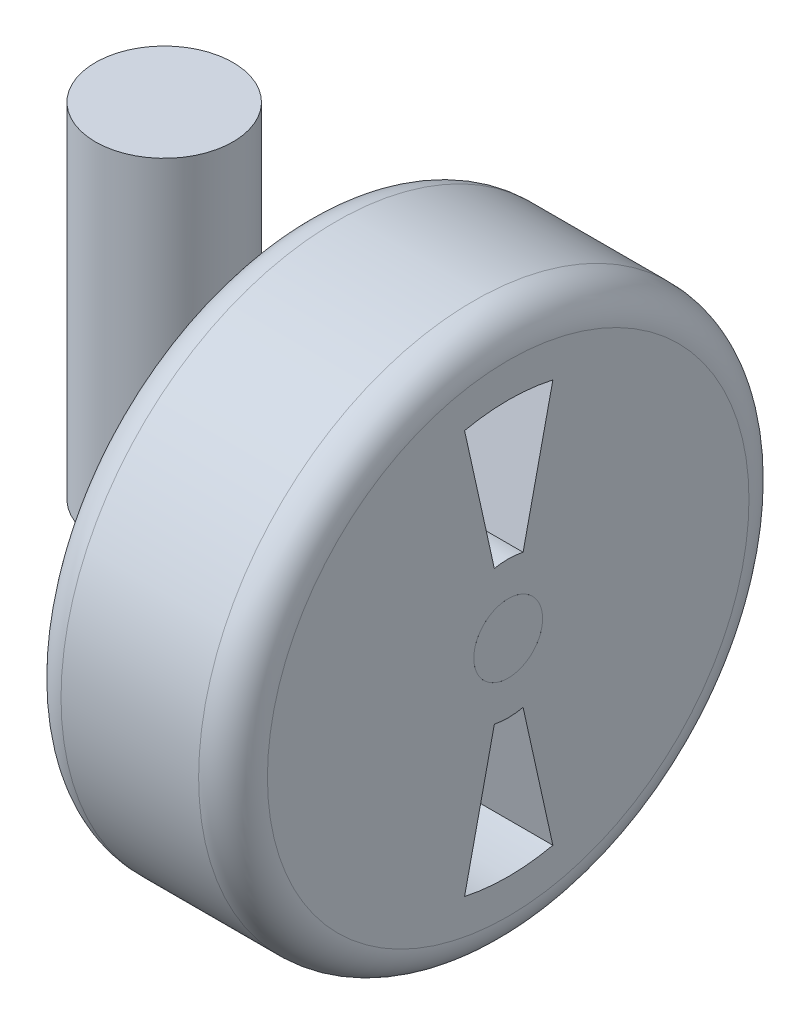
ISO-10303-21;
HEADER;
FILE_DESCRIPTION(('STEP AP214'),'2;1');
FILE_NAME('part.step','',(''),(''),'','','');
FILE_SCHEMA(('AUTOMOTIVE_DESIGN { 1 0 10303 214 1 1 1 1 }'));
ENDSEC;
DATA;
#1=APPLICATION_CONTEXT('core data for automotive mechanical design processes');
#2=APPLICATION_PROTOCOL_DEFINITION('international standard','automotive_design',2000,#1);
#3=PRODUCT_CONTEXT('',#1,'mechanical');
#4=PRODUCT('Part','Part','',(#3));
#5=PRODUCT_RELATED_PRODUCT_CATEGORY('part','',(#4));
#6=PRODUCT_DEFINITION_FORMATION('','',#4);
#7=PRODUCT_DEFINITION_CONTEXT('part definition',#1,'design');
#8=PRODUCT_DEFINITION('design','',#6,#7);
#9=PRODUCT_DEFINITION_SHAPE('','',#8);
#10=(LENGTH_UNIT() NAMED_UNIT(*) SI_UNIT(.MILLI.,.METRE.));
#11=(NAMED_UNIT(*) PLANE_ANGLE_UNIT() SI_UNIT($,.RADIAN.));
#12=(NAMED_UNIT(*) SI_UNIT($,.STERADIAN.) SOLID_ANGLE_UNIT());
#13=UNCERTAINTY_MEASURE_WITH_UNIT(LENGTH_MEASURE(1.E-05),#10,'distance_accuracy_value','');
#14=(GEOMETRIC_REPRESENTATION_CONTEXT(3) GLOBAL_UNCERTAINTY_ASSIGNED_CONTEXT((#13)) GLOBAL_UNIT_ASSIGNED_CONTEXT((#10,
#11,#12)) REPRESENTATION_CONTEXT('',''));
#15=CARTESIAN_POINT('',(0.,0.,0.));
#16=DIRECTION('',(0.,0.,1.));
#17=DIRECTION('',(1.,0.,0.));
#18=AXIS2_PLACEMENT_3D('',#15,#16,#17);
#19=CARTESIAN_POINT('',(0.,127.,0.));
#20=DIRECTION('',(0.,-1.,0.));
#21=DIRECTION('',(0.,0.,-1.));
#22=AXIS2_PLACEMENT_3D('',#19,#20,#21);
#23=CYLINDRICAL_SURFACE('',#22,25.4);
#24=CARTESIAN_POINT('',(21.9970452561247,19.05,-12.7));
#25=CARTESIAN_POINT('',(21.9970471602128,19.3810420807461,-12.6999985647494));
#26=CARTESIAN_POINT('',(22.0045437862155,19.7121130244855,-12.6870391369613));
#27=CARTESIAN_POINT('',(22.0342519284664,20.3717034976564,-12.6353713338878));
#28=CARTESIAN_POINT('',(22.0564702952349,20.7002217672053,-12.5966509711401));
#29=CARTESIAN_POINT('',(22.1148440208644,21.3526264227658,-12.4938849250183));
#30=CARTESIAN_POINT('',(22.1510249211168,21.6765031854515,-12.4297928240411));
#31=CARTESIAN_POINT('',(22.2360170030325,22.316670048592,-12.2770991138377));
#32=CARTESIAN_POINT('',(22.284826974256,22.6329608729521,-12.1884998534566));
#33=CARTESIAN_POINT('',(22.3931480103301,23.2543012598049,-11.9883186278969));
#34=CARTESIAN_POINT('',(22.4525983094468,23.5594033801427,-11.8768666712366));
#35=CARTESIAN_POINT('',(22.5805721347808,24.1586234616995,-11.6317181381331));
#36=CARTESIAN_POINT('',(22.6490991713607,24.4527371165001,-11.4980129502544));
#37=CARTESIAN_POINT('',(22.8653561130759,25.3161442355337,-11.0652401328367));
#38=CARTESIAN_POINT('',(23.0238704837284,25.8670919696492,-10.7343236683619));
#39=CARTESIAN_POINT('',(23.3676412352835,26.953442979612,-9.96516055573082));
#40=CARTESIAN_POINT('',(23.5540249305769,27.4838162959334,-9.5203126301066));
#41=CARTESIAN_POINT('',(23.8309378120557,28.2203478300108,-8.79284622642539));
#42=CARTESIAN_POINT('',(23.9228647991282,28.4561715803135,-8.54011742208882));
#43=CARTESIAN_POINT('',(24.1036457517521,28.9068945224131,-8.01567565449754));
#44=CARTESIAN_POINT('',(24.1925008194246,29.121801269966,-7.7439696076812));
#45=CARTESIAN_POINT('',(24.370853998843,29.5432075794466,-7.16377890210735));
#46=CARTESIAN_POINT('',(24.4599875552318,29.7481502259311,-6.85404964117503));
#47=CARTESIAN_POINT('',(24.6298470545705,30.1310109612756,-6.21607422891501));
#48=CARTESIAN_POINT('',(24.7105725146455,30.3089274983018,-5.88782701577314));
#49=CARTESIAN_POINT('',(24.8612516926925,30.6358915031511,-5.21506652074053));
#50=CARTESIAN_POINT('',(24.9312106298145,30.7849529677731,-4.87056122657622));
#51=CARTESIAN_POINT('',(25.0583005241644,31.0525958823117,-4.16762302685623));
#52=CARTESIAN_POINT('',(25.11543284386,31.1711805697233,-3.80919160530934));
#53=CARTESIAN_POINT('',(25.2115397591581,31.369036569119,-3.10720251540758));
#54=CARTESIAN_POINT('',(25.2515169220277,31.4505044171783,-2.76440059738313));
#55=CARTESIAN_POINT('',(25.3177425338566,31.5848119416637,-2.07192012055632));
#56=CARTESIAN_POINT('',(25.3439915797081,31.637652862779,-1.72224186142015));
#57=CARTESIAN_POINT('',(25.3819888668002,31.7139825733086,-1.01909136302437));
#58=CARTESIAN_POINT('',(25.3937444976109,31.7374863205646,-0.665621149929051));
#59=CARTESIAN_POINT('',(25.4024302708841,31.7548623520299,0.0422200815740275));
#60=CARTESIAN_POINT('',(25.3993613203907,31.7487364491338,0.396591043543345));
#61=CARTESIAN_POINT('',(25.3794055661792,31.7087707869769,1.07234401308664));
#62=CARTESIAN_POINT('',(25.3637453457987,31.6773909089866,1.39391142368825));
#63=CARTESIAN_POINT('',(25.320540629412,31.5903830254822,2.03291731220707));
#64=CARTESIAN_POINT('',(25.2929969701013,31.5347567271201,2.35035607919535));
#65=CARTESIAN_POINT('',(25.2266850381294,31.39986165508,2.97897125371334));
#66=CARTESIAN_POINT('',(25.1879163998152,31.3205921112222,3.29014745688725));
#67=CARTESIAN_POINT('',(25.1000573303477,31.1392170400231,3.90427386213677));
#68=CARTESIAN_POINT('',(25.0509665284666,31.0371106924736,4.20722376831778));
#69=CARTESIAN_POINT('',(24.9428270563849,30.8094553501855,4.80724352433844));
#70=CARTESIAN_POINT('',(24.8836506570485,30.6836031085568,5.1041750988441));
#71=CARTESIAN_POINT('',(24.7571386689521,30.4104823246213,5.68619260071747));
#72=CARTESIAN_POINT('',(24.6898030899667,30.2632138079709,5.9712785422755));
#73=CARTESIAN_POINT('',(24.5484061586244,29.9483499085496,6.52827145034378));
#74=CARTESIAN_POINT('',(24.4743441844574,29.7807526460411,6.80017719486261));
#75=CARTESIAN_POINT('',(24.321008981523,29.4262720280837,7.32970282693975));
#76=CARTESIAN_POINT('',(24.241733732656,29.2393811803602,7.58731710454069));
#77=CARTESIAN_POINT('',(24.0719525020219,28.8289077346986,8.1107189326513));
#78=CARTESIAN_POINT('',(23.9810927057987,28.6035269187307,8.37498325169425));
#79=CARTESIAN_POINT('',(23.7972913728668,28.1322983961376,8.88381203754073));
#80=CARTESIAN_POINT('',(23.7043497188136,27.8864495336934,9.12837539030551));
#81=CARTESIAN_POINT('',(23.5186138315105,27.3753768985287,9.59678718723074));
#82=CARTESIAN_POINT('',(23.4258197341869,27.1101405767493,9.82062199798168));
#83=CARTESIAN_POINT('',(23.2427999635405,26.561630821775,10.2462645447203));
#84=CARTESIAN_POINT('',(23.1525747518022,26.2783541762739,10.4480683403477));
#85=CARTESIAN_POINT('',(22.9715514343696,25.6764402643528,10.8405474751142));
#86=CARTESIAN_POINT('',(22.8810846524641,25.3567000961703,11.0296893051339));
#87=CARTESIAN_POINT('',(22.7088984125069,24.7001621973306,11.3799836986017));
#88=CARTESIAN_POINT('',(22.6271749714927,24.3633723374261,11.5411490275416));
#89=CARTESIAN_POINT('',(22.4754617527209,23.6748286806348,11.8338838194025));
#90=CARTESIAN_POINT('',(22.4054650808563,23.3230838293027,11.9654706870086));
#91=CARTESIAN_POINT('',(22.2799865885559,22.6069602897252,12.1975260044049));
#92=CARTESIAN_POINT('',(22.2245027890992,22.242583331716,12.2979986973657));
#93=CARTESIAN_POINT('',(22.1342262843656,21.5334790141535,12.4596912887769));
#94=CARTESIAN_POINT('',(22.098142911759,21.1894808921785,12.5233897061292));
#95=CARTESIAN_POINT('',(22.0418220540794,20.4961162926004,12.6222558976789));
#96=CARTESIAN_POINT('',(22.0215836735453,20.1467501195044,12.6574252841648));
#97=CARTESIAN_POINT('',(21.9978227828486,19.4459470423252,12.6986756625791));
#98=CARTESIAN_POINT('',(21.994290174051,19.0945115178566,12.7047742278297));
#99=CARTESIAN_POINT('',(22.0040693445831,18.392593499876,12.6878302022715));
#100=CARTESIAN_POINT('',(22.0173799869267,18.0421109436354,12.6647895784734));
#101=CARTESIAN_POINT('',(22.0579043046366,17.3835445009991,12.5940573760551));
#102=CARTESIAN_POINT('',(22.0834315216201,17.0750295052712,12.5493492475133));
#103=CARTESIAN_POINT('',(22.1465318454431,16.4632099329642,12.4376541859353));
#104=CARTESIAN_POINT('',(22.184108940291,16.1599071164627,12.3706598768256));
#105=CARTESIAN_POINT('',(22.2701258086824,15.5605171053264,12.215128963231));
#106=CARTESIAN_POINT('',(22.3185641324,15.2644289534753,12.1265952338312));
#107=CARTESIAN_POINT('',(22.4249117667195,14.6809014913133,11.9287859618344));
#108=CARTESIAN_POINT('',(22.4828248323198,14.3934656637554,11.8195021928819));
#109=CARTESIAN_POINT('',(22.6093845553946,13.8157553865419,11.5756402427838));
#110=CARTESIAN_POINT('',(22.6784016201461,13.5259551192354,11.4401320002685));
#111=CARTESIAN_POINT('',(22.8232288817731,12.9586078091804,11.1483965411298));
#112=CARTESIAN_POINT('',(22.8990419788175,12.6810660738329,10.9921604652366));
#113=CARTESIAN_POINT('',(23.0555590560225,12.1394250404758,10.6599674616086));
#114=CARTESIAN_POINT('',(23.1362640138934,11.875328449211,10.4840065855742));
#115=CARTESIAN_POINT('',(23.3006827313257,11.3616293649374,10.113322779748));
#116=CARTESIAN_POINT('',(23.3843967051249,11.1120279072843,9.91859851236337));
#117=CARTESIAN_POINT('',(23.5636645058326,10.5976922140596,9.4855329974286));
#118=CARTESIAN_POINT('',(23.6593777533432,10.3350312258121,9.2447894502468));
#119=CARTESIAN_POINT('',(23.8497410423583,9.83074538024891,8.74197321743339));
#120=CARTESIAN_POINT('',(23.9443913904567,9.58911431363089,8.47990687209977));
#121=CARTESIAN_POINT('',(24.1302993318609,9.12800953049297,7.93545520062454));
#122=CARTESIAN_POINT('',(24.2215543349948,8.90855251925937,7.65305482570265));
#123=CARTESIAN_POINT('',(24.3982173985347,8.49356827963927,7.06964182281789));
#124=CARTESIAN_POINT('',(24.4836279404689,8.29803086698485,6.76863719875104));
#125=CARTESIAN_POINT('',(24.6485996720327,7.92742205617927,6.14121491873794));
#126=CARTESIAN_POINT('',(24.7279432691808,7.75303806015415,5.81433284669376));
#127=CARTESIAN_POINT('',(24.8759160322661,7.43271184087587,5.14455133013142));
#128=CARTESIAN_POINT('',(24.9445448390965,7.28677057084116,4.80165134927256));
#129=CARTESIAN_POINT('',(25.0690086800244,7.02509088055367,4.10253106573799));
#130=CARTESIAN_POINT('',(25.1248528498603,6.9093308848819,3.74632048771279));
#131=CARTESIAN_POINT('',(25.2220758898254,6.70938578449528,3.02322650574832));
#132=CARTESIAN_POINT('',(25.2634564752322,6.625196935582,2.65634437297284));
#133=CARTESIAN_POINT('',(25.3273539195209,6.49580929596041,1.94920235554088));
#134=CARTESIAN_POINT('',(25.3512536510551,6.44774089246716,1.60959001490067));
#135=CARTESIAN_POINT('',(25.3853816074126,6.37922689235229,0.926912035885021));
#136=CARTESIAN_POINT('',(25.3956106999074,6.35877954262954,0.583846618068023));
#137=CARTESIAN_POINT('',(25.4021120060045,6.34577535186779,-0.102839446284004));
#138=CARTESIAN_POINT('',(25.3983883777696,6.35321020143045,-0.446459896899585));
#139=CARTESIAN_POINT('',(25.3770971994885,6.3958542023007,-1.13153389091492));
#140=CARTESIAN_POINT('',(25.3595300305546,6.4310625890036,-1.47298749370707));
#141=CARTESIAN_POINT('',(25.3126435066068,6.52556490034316,-2.12858527568835));
#142=CARTESIAN_POINT('',(25.2841765669811,6.58311530426898,-2.44304419112651));
#143=CARTESIAN_POINT('',(25.2162691565626,6.72142103246127,-3.0655837436746));
#144=CARTESIAN_POINT('',(25.1768293052811,6.80217504670158,-3.3736647398158));
#145=CARTESIAN_POINT('',(25.0878735123424,6.9860922027362,-3.98158173319984));
#146=CARTESIAN_POINT('',(25.0383567873887,7.08925708661679,-4.28141708743362));
#147=CARTESIAN_POINT('',(24.9303397913062,7.31705941391041,-4.87114333181489));
#148=CARTESIAN_POINT('',(24.8718391009164,7.44169785947861,-5.16103375708247));
#149=CARTESIAN_POINT('',(24.7444293333949,7.71720104299412,-5.74153755123178));
#150=CARTESIAN_POINT('',(24.6751823649851,7.86895872813089,-6.03165271619898));
#151=CARTESIAN_POINT('',(24.5298098520684,8.19354461094811,-6.59802427573064));
#152=CARTESIAN_POINT('',(24.4536841788377,8.3663732029571,-6.87428041079562));
#153=CARTESIAN_POINT('',(24.2961802971371,8.73197718704439,-7.41175170677076));
#154=CARTESIAN_POINT('',(24.2148010722428,8.92475644342996,-7.67296393847169));
#155=CARTESIAN_POINT('',(24.0484958467777,9.32919030921192,-8.17929680023456));
#156=CARTESIAN_POINT('',(23.9635684730117,9.54085226320227,-8.42441110393882));
#157=CARTESIAN_POINT('',(23.7834500990398,10.0038737885493,-8.92098717319141));
#158=CARTESIAN_POINT('',(23.688078153342,10.2570879541916,-9.17065712465206));
#159=CARTESIAN_POINT('',(23.4977167440241,10.783626008772,-9.64797087813653));
#160=CARTESIAN_POINT('',(23.4027272917455,11.0569504894491,-9.87561403157303));
#161=CARTESIAN_POINT('',(23.2156147898567,11.6226144173546,-10.3077994956351));
#162=CARTESIAN_POINT('',(23.123494190191,11.914969491805,-10.5123224338757));
#163=CARTESIAN_POINT('',(22.9448378372625,12.5171405545823,-10.896759382453));
#164=CARTESIAN_POINT('',(22.858302987056,12.826959351203,-11.0766694188231));
#165=CARTESIAN_POINT('',(22.6908951069765,13.4726363779299,-11.4157868639676));
#166=CARTESIAN_POINT('',(22.6102916419609,13.8090104904963,-11.5741482082511));
#167=CARTESIAN_POINT('',(22.4609070473123,14.4964526984344,-11.8614454203001));
#168=CARTESIAN_POINT('',(22.3921197744437,14.847513039658,-11.9903965899069));
#169=CARTESIAN_POINT('',(22.2692493503278,15.5610701147008,-12.2170838217044));
#170=CARTESIAN_POINT('',(22.2151284619609,15.9235347671628,-12.3149001105845));
#171=CARTESIAN_POINT('',(22.1237750343668,16.6575556131312,-12.4782771120638));
#172=CARTESIAN_POINT('',(22.0865306888318,17.0291052586806,-12.5438603766174));
#173=CARTESIAN_POINT('',(22.0382476199109,17.675854352842,-12.6284304598707));
#174=CARTESIAN_POINT('',(22.0228342714581,17.9497333710954,-12.6552434069377));
#175=CARTESIAN_POINT('',(22.0022319553292,18.4990681944843,-12.6910293708987));
#176=CARTESIAN_POINT('',(21.9970436716423,18.7745241038674,-12.7000011943404));
#177=CARTESIAN_POINT('',(21.9970452561247,19.05,-12.7));
#178=B_SPLINE_CURVE_WITH_KNOTS('',3,(#24,#25,#26,#27,#28,#29,#30,#31,#32,#33,#34,#35,#36,#37,
#38,#39,#40,#41,#42,#43,#44,#45,#46,#47,#48,#49,#50,#51,#52,#53,#54,#55,#56,#57,#58,#59,#60,#61,
#62,#63,#64,#65,#66,#67,#68,#69,#70,#71,#72,#73,#74,#75,#76,#77,#78,#79,#80,#81,#82,#83,#84,#85,
#86,#87,#88,#89,#90,#91,#92,#93,#94,#95,#96,#97,#98,#99,#100,#101,#102,#103,#104,#105,#106,#107,
#108,#109,#110,#111,#112,#113,#114,#115,#116,#117,#118,#119,#120,#121,#122,#123,#124,#125,#126,
#127,#128,#129,#130,#131,#132,#133,#134,#135,#136,#137,#138,#139,#140,#141,#142,#143,#144,#145,
#146,#147,#148,#149,#150,#151,#152,#153,#154,#155,#156,#157,#158,#159,#160,#161,#162,#163,#164,
#165,#166,#167,#168,#169,#170,#171,#172,#173,#174,#175,#176,#177),.UNSPECIFIED.,.T.,.F.,(4,2,2,
2,2,2,2,2,2,2,2,2,2,2,2,2,2,2,2,2,2,2,2,2,2,2,2,2,2,2,2,2,2,2,2,2,2,2,2,2,2,2,2,2,2,2,2,2,2,2,2,
2,2,2,2,2,2,2,2,2,2,2,2,2,2,2,2,2,2,2,2,2,2,2,2,2,4),(0.,0.992841256773457,1.98614484069135,
2.98127413516308,3.97630808626216,4.96583099917635,5.95573772646566,7.93368817155649,
10.0747759271307,11.1468942610208,12.218623869757,13.3629886651861,14.5074191449963,
15.6512930944215,16.7950454818372,17.857435006988,18.9197783360939,19.9815797976435,
21.0433162935313,22.0125928506763,22.9818011736155,23.9510410720043,24.9203157872719,
25.9029281283044,26.8855392921968,27.8682413845279,28.8513265352096,29.9271929305077,
31.0031201206287,32.0797500083507,33.1565721424736,34.3021563419872,35.4472164371095,
36.5916009769249,37.7358293834202,38.789438498316,39.8429880654364,40.8959006806151,
41.9487422238141,42.886017324986,43.8236029459353,44.7610634864151,45.6988964621831,
46.6797322342173,47.6609885833768,48.6424417018712,49.623964837417,50.7295147964185,
51.8347372150265,52.9407861630636,54.0463625363864,55.1815136853403,56.3167028707683,
57.4510783146944,58.5853191841304,59.6154461363638,60.6455077036341,61.675262318375,
62.7049885849902,63.6667347316751,64.6284265908971,65.5901932330307,66.5520047722631,
67.5549064405592,68.5578268804,69.5609419439473,70.5644488935119,71.6677265518938,
72.7710366868203,73.8752645363012,74.9796704630673,76.1193951815199,77.2585255520905,
78.3946964541357,79.5300712943583,80.3562065716749,81.1823971100821),.UNSPECIFIED.);
#179=CARTESIAN_POINT('',(21.9970452561247,19.05,-12.7));
#180=VERTEX_POINT('',#179);
#181=EDGE_CURVE('P0_E25',#180,#180,#178,.T.);
#182=ORIENTED_EDGE('',*,*,#181,.F.);
#183=EDGE_LOOP('',(#182));
#184=FACE_BOUND('',#183,.T.);
#185=CARTESIAN_POINT('',(0.,127.,0.));
#186=DIRECTION('',(0.,1.,0.));
#187=DIRECTION('',(0.,0.,1.));
#188=AXIS2_PLACEMENT_3D('',#185,#186,#187);
#189=CIRCLE('',#188,25.4);
#190=CARTESIAN_POINT('',(0.,127.,25.4));
#191=VERTEX_POINT('',#190);
#192=EDGE_CURVE('P0_E10',#191,#191,#189,.T.);
#193=ORIENTED_EDGE('',*,*,#192,.F.);
#194=EDGE_LOOP('',(#193));
#195=FACE_BOUND('',#194,.T.);
#196=CARTESIAN_POINT('',(0.,0.,0.));
#197=DIRECTION('',(0.,1.,0.));
#198=DIRECTION('',(0.,0.,1.));
#199=AXIS2_PLACEMENT_3D('',#196,#197,#198);
#200=CIRCLE('',#199,25.4);
#201=CARTESIAN_POINT('',(0.,0.,25.4));
#202=VERTEX_POINT('',#201);
#203=EDGE_CURVE('P0_E18',#202,#202,#200,.T.);
#204=ORIENTED_EDGE('',*,*,#203,.T.);
#205=EDGE_LOOP('',(#204));
#206=FACE_BOUND('',#205,.T.);
#207=ADVANCED_FACE('P0_F15',(#184,#195,#206),#23,.T.);
#208=CARTESIAN_POINT('',(0.,127.,0.));
#209=DIRECTION('',(0.,1.,0.));
#210=DIRECTION('',(0.,0.,1.));
#211=AXIS2_PLACEMENT_3D('',#208,#209,#210);
#212=PLANE('',#211);
#213=ORIENTED_EDGE('',*,*,#192,.T.);
#214=EDGE_LOOP('',(#213));
#215=FACE_BOUND('',#214,.T.);
#216=ADVANCED_FACE('P0_F50',(#215),#212,.T.);
#217=CARTESIAN_POINT('',(0.,0.,0.));
#218=DIRECTION('',(0.,1.,0.));
#219=DIRECTION('',(0.,0.,1.));
#220=AXIS2_PLACEMENT_3D('',#217,#218,#219);
#221=PLANE('',#220);
#222=ORIENTED_EDGE('',*,*,#203,.F.);
#223=EDGE_LOOP('',(#222));
#224=FACE_BOUND('',#223,.T.);
#225=ADVANCED_FACE('P0_F42',(#224),#221,.F.);
#226=CARTESIAN_POINT('',(127.,19.05,0.));
#227=DIRECTION('',(1.,0.,0.));
#228=DIRECTION('',(0.,0.,-1.));
#229=AXIS2_PLACEMENT_3D('',#226,#227,#228);
#230=PLANE('',#229);
#231=CARTESIAN_POINT('',(127.,19.05,0.));
#232=DIRECTION('',(1.,0.,0.));
#233=DIRECTION('',(0.,0.,-1.));
#234=AXIS2_PLACEMENT_3D('',#231,#232,#233);
#235=CIRCLE('',#234,12.7);
#236=CARTESIAN_POINT('',(127.,19.05,-12.7));
#237=VERTEX_POINT('',#236);
#238=EDGE_CURVE('P0_E34',#237,#237,#235,.T.);
#239=ORIENTED_EDGE('',*,*,#238,.T.);
#240=EDGE_LOOP('',(#239));
#241=FACE_BOUND('',#240,.T.);
#242=ADVANCED_FACE('P0_F40',(#241),#230,.T.);
#243=CARTESIAN_POINT('',(-25.401,19.05,0.));
#244=DIRECTION('',(1.,0.,0.));
#245=DIRECTION('',(0.,0.,-1.));
#246=AXIS2_PLACEMENT_3D('',#243,#244,#245);
#247=CYLINDRICAL_SURFACE('',#246,12.7);
#248=ORIENTED_EDGE('',*,*,#238,.F.);
#249=EDGE_LOOP('',(#248));
#250=FACE_BOUND('',#249,.T.);
#251=ORIENTED_EDGE('',*,*,#181,.T.);
#252=EDGE_LOOP('',(#251));
#253=FACE_BOUND('',#252,.T.);
#254=ADVANCED_FACE('P0_F35',(#250,#253),#247,.T.);
#255=CLOSED_SHELL('',(#207,#216,#225,#242,#254));
#256=MANIFOLD_SOLID_BREP('P0_B1',#255);
#257=CARTESIAN_POINT('',(127.,19.05,0.));
#258=DIRECTION('',(-1.,0.,0.));
#259=DIRECTION('',(0.,0.,1.));
#260=AXIS2_PLACEMENT_3D('',#257,#258,#259);
#261=PLANE('',#260);
#262=CARTESIAN_POINT('',(127.,19.05,0.));
#263=DIRECTION('',(-1.,0.,0.));
#264=DIRECTION('',(0.,0.,1.));
#265=AXIS2_PLACEMENT_3D('',#262,#263,#264);
#266=CIRCLE('',#265,12.7);
#267=CARTESIAN_POINT('',(127.,19.05,12.7));
#268=VERTEX_POINT('',#267);
#269=EDGE_CURVE('P1_E147',#268,#268,#266,.T.);
#270=ORIENTED_EDGE('',*,*,#269,.T.);
#271=EDGE_LOOP('',(#270));
#272=FACE_BOUND('',#271,.T.);
#273=CARTESIAN_POINT('',(127.,19.05,0.));
#274=DIRECTION('',(-1.,0.,0.));
#275=DIRECTION('',(0.,0.,1.));
#276=AXIS2_PLACEMENT_3D('',#273,#274,#275);
#277=CIRCLE('',#276,88.9);
#278=CARTESIAN_POINT('',(127.,19.05,88.9));
#279=VERTEX_POINT('',#278);
#280=EDGE_CURVE('P1_E10',#279,#279,#277,.F.);
#281=ORIENTED_EDGE('',*,*,#280,.T.);
#282=EDGE_LOOP('',(#281));
#283=FACE_BOUND('',#282,.T.);
#284=DIRECTION('',(0.,-0.976296007119933,0.216439613938104));
#285=VECTOR('',#284,1.);
#286=CARTESIAN_POINT('',(127.,43.8479185808463,-5.49756619402784));
#287=LINE('',#286,#285);
#288=CARTESIAN_POINT('',(127.,93.4518390712533,-16.4944906129159));
#289=VERTEX_POINT('',#288);
#290=CARTESIAN_POINT('',(127.,43.8479185808463,-5.49756619402784));
#291=VERTEX_POINT('',#290);
#292=EDGE_CURVE('P1_E125',#289,#291,#287,.T.);
#293=ORIENTED_EDGE('',*,*,#292,.T.);
#294=CARTESIAN_POINT('',(127.,19.05,0.));
#295=DIRECTION('',(1.,0.,0.));
#296=DIRECTION('',(0.,0.,1.));
#297=AXIS2_PLACEMENT_3D('',#294,#295,#296);
#298=CIRCLE('',#297,25.4);
#299=CARTESIAN_POINT('',(127.,43.9305500937605,5.11059947871828));
#300=VERTEX_POINT('',#299);
#301=EDGE_CURVE('P1_E115',#291,#300,#298,.T.);
#302=ORIENTED_EDGE('',*,*,#301,.T.);
#303=DIRECTION('',(0.,0.976296007119933,0.216439613938103));
#304=VECTOR('',#303,1.);
#305=CARTESIAN_POINT('',(127.,43.9305500937605,5.11059947871828));
#306=LINE('',#305,#304);
#307=CARTESIAN_POINT('',(127.,93.536476781913,16.1079686609387));
#308=VERTEX_POINT('',#307);
#309=EDGE_CURVE('P1_E118',#300,#308,#306,.T.);
#310=ORIENTED_EDGE('',*,*,#309,.T.);
#311=CARTESIAN_POINT('',(127.,19.05,0.));
#312=DIRECTION('',(-1.,0.,0.));
#313=DIRECTION('',(0.,0.,1.));
#314=AXIS2_PLACEMENT_3D('',#311,#312,#313);
#315=CIRCLE('',#314,76.2082795880097);
#316=EDGE_CURVE('P1_E122',#308,#289,#315,.T.);
#317=ORIENTED_EDGE('',*,*,#316,.T.);
#318=EDGE_LOOP('',(#293,#302,#310,#317));
#319=FACE_BOUND('',#318,.T.);
#320=CARTESIAN_POINT('',(127.,19.05,0.));
#321=DIRECTION('',(-1.,0.,0.));
#322=DIRECTION('',(0.,0.,1.));
#323=AXIS2_PLACEMENT_3D('',#320,#321,#322);
#324=CIRCLE('',#323,25.4);
#325=CARTESIAN_POINT('',(127.,-5.7479185808463,-5.49756619402784));
#326=VERTEX_POINT('',#325);
#327=CARTESIAN_POINT('',(127.,-5.83055009376048,5.11059947871828));
#328=VERTEX_POINT('',#327);
#329=EDGE_CURVE('P1_E89',#326,#328,#324,.T.);
#330=ORIENTED_EDGE('',*,*,#329,.F.);
#331=DIRECTION('',(0.,0.976296007119933,0.216439613938104));
#332=VECTOR('',#331,1.);
#333=CARTESIAN_POINT('',(127.,-5.7479185808463,-5.49756619402784));
#334=LINE('',#333,#332);
#335=CARTESIAN_POINT('',(127.,-55.3518390712534,-16.4944906129159));
#336=VERTEX_POINT('',#335);
#337=EDGE_CURVE('P1_E81',#336,#326,#334,.T.);
#338=ORIENTED_EDGE('',*,*,#337,.F.);
#339=CARTESIAN_POINT('',(127.,19.05,0.));
#340=DIRECTION('',(1.,0.,0.));
#341=DIRECTION('',(0.,0.,1.));
#342=AXIS2_PLACEMENT_3D('',#339,#340,#341);
#343=CIRCLE('',#342,76.2082795880097);
#344=CARTESIAN_POINT('',(127.,-55.436476781913,16.1079686609387));
#345=VERTEX_POINT('',#344);
#346=EDGE_CURVE('P1_E88',#345,#336,#343,.T.);
#347=ORIENTED_EDGE('',*,*,#346,.F.);
#348=DIRECTION('',(0.,-0.976296007119933,0.216439613938103));
#349=VECTOR('',#348,1.);
#350=CARTESIAN_POINT('',(127.,-5.83055009376048,5.11059947871828));
#351=LINE('',#350,#349);
#352=EDGE_CURVE('P1_E93',#328,#345,#351,.T.);
#353=ORIENTED_EDGE('',*,*,#352,.F.);
#354=EDGE_LOOP('',(#330,#338,#347,#353));
#355=FACE_BOUND('',#354,.T.);
#356=ADVANCED_FACE('P1_F16',(#272,#283,#319,#355),#261,.F.);
#357=CARTESIAN_POINT('',(50.8,19.05,0.));
#358=DIRECTION('',(-1.,0.,0.));
#359=DIRECTION('',(0.,0.,1.));
#360=AXIS2_PLACEMENT_3D('',#357,#358,#359);
#361=PLANE('',#360);
#362=CARTESIAN_POINT('',(50.8,19.05,0.));
#363=DIRECTION('',(1.,0.,0.));
#364=DIRECTION('',(0.,0.,1.));
#365=AXIS2_PLACEMENT_3D('',#362,#363,#364);
#366=CIRCLE('',#365,25.4);
#367=CARTESIAN_POINT('',(50.8,43.8479185808463,-5.49756619402784));
#368=VERTEX_POINT('',#367);
#369=CARTESIAN_POINT('',(50.8,43.9305500937605,5.11059947871828));
#370=VERTEX_POINT('',#369);
#371=EDGE_CURVE('P1_E111',#368,#370,#366,.T.);
#372=ORIENTED_EDGE('',*,*,#371,.F.);
#373=DIRECTION('',(0.,-0.976296007119933,0.216439613938104));
#374=VECTOR('',#373,1.);
#375=CARTESIAN_POINT('',(50.8,43.8479185808463,-5.49756619402784));
#376=LINE('',#375,#374);
#377=CARTESIAN_POINT('',(50.8,93.4518390712533,-16.4944906129159));
#378=VERTEX_POINT('',#377);
#379=EDGE_CURVE('P1_E119',#378,#368,#376,.T.);
#380=ORIENTED_EDGE('',*,*,#379,.F.);
#381=CARTESIAN_POINT('',(50.8,19.05,0.));
#382=DIRECTION('',(-1.,0.,0.));
#383=DIRECTION('',(0.,0.,1.));
#384=AXIS2_PLACEMENT_3D('',#381,#382,#383);
#385=CIRCLE('',#384,76.2082795880097);
#386=CARTESIAN_POINT('',(50.8,93.536476781913,16.1079686609387));
#387=VERTEX_POINT('',#386);
#388=EDGE_CURVE('P1_E133',#387,#378,#385,.T.);
#389=ORIENTED_EDGE('',*,*,#388,.F.);
#390=DIRECTION('',(0.,0.976296007119933,0.216439613938103));
#391=VECTOR('',#390,1.);
#392=CARTESIAN_POINT('',(50.8,43.9305500937605,5.11059947871828));
#393=LINE('',#392,#391);
#394=EDGE_CURVE('P1_E130',#370,#387,#393,.T.);
#395=ORIENTED_EDGE('',*,*,#394,.F.);
#396=EDGE_LOOP('',(#372,#380,#389,#395));
#397=FACE_BOUND('',#396,.T.);
#398=CARTESIAN_POINT('',(50.8,19.05,0.));
#399=DIRECTION('',(-1.,0.,0.));
#400=DIRECTION('',(0.,0.,1.));
#401=AXIS2_PLACEMENT_3D('',#398,#399,#400);
#402=CIRCLE('',#401,88.9);
#403=CARTESIAN_POINT('',(50.8,19.05,88.9));
#404=VERTEX_POINT('',#403);
#405=EDGE_CURVE('P1_E150',#404,#404,#402,.T.);
#406=ORIENTED_EDGE('',*,*,#405,.T.);
#407=EDGE_LOOP('',(#406));
#408=FACE_BOUND('',#407,.T.);
#409=CARTESIAN_POINT('',(50.8,19.05,0.));
#410=DIRECTION('',(-1.,0.,0.));
#411=DIRECTION('',(0.,0.,1.));
#412=AXIS2_PLACEMENT_3D('',#409,#410,#411);
#413=CIRCLE('',#412,12.7);
#414=CARTESIAN_POINT('',(50.8,19.05,12.7));
#415=VERTEX_POINT('',#414);
#416=EDGE_CURVE('P1_E140',#415,#415,#413,.T.);
#417=ORIENTED_EDGE('',*,*,#416,.F.);
#418=EDGE_LOOP('',(#417));
#419=FACE_BOUND('',#418,.T.);
#420=DIRECTION('',(0.,0.976296007119933,0.216439613938104));
#421=VECTOR('',#420,1.);
#422=CARTESIAN_POINT('',(50.8,-5.7479185808463,-5.49756619402784));
#423=LINE('',#422,#421);
#424=CARTESIAN_POINT('',(50.8,-55.3518390712534,-16.4944906129159));
#425=VERTEX_POINT('',#424);
#426=CARTESIAN_POINT('',(50.8,-5.7479185808463,-5.49756619402784));
#427=VERTEX_POINT('',#426);
#428=EDGE_CURVE('P1_E105',#425,#427,#423,.T.);
#429=ORIENTED_EDGE('',*,*,#428,.T.);
#430=CARTESIAN_POINT('',(50.8,19.05,0.));
#431=DIRECTION('',(-1.,0.,0.));
#432=DIRECTION('',(0.,0.,1.));
#433=AXIS2_PLACEMENT_3D('',#430,#431,#432);
#434=CIRCLE('',#433,25.4);
#435=CARTESIAN_POINT('',(50.8,-5.83055009376048,5.11059947871828));
#436=VERTEX_POINT('',#435);
#437=EDGE_CURVE('P1_E39',#427,#436,#434,.T.);
#438=ORIENTED_EDGE('',*,*,#437,.T.);
#439=DIRECTION('',(0.,-0.976296007119933,0.216439613938103));
#440=VECTOR('',#439,1.);
#441=CARTESIAN_POINT('',(50.8,-5.83055009376048,5.11059947871828));
#442=LINE('',#441,#440);
#443=CARTESIAN_POINT('',(50.8,-55.436476781913,16.1079686609387));
#444=VERTEX_POINT('',#443);
#445=EDGE_CURVE('P1_E96',#436,#444,#442,.T.);
#446=ORIENTED_EDGE('',*,*,#445,.T.);
#447=CARTESIAN_POINT('',(50.8,19.05,0.));
#448=DIRECTION('',(1.,0.,0.));
#449=DIRECTION('',(0.,0.,1.));
#450=AXIS2_PLACEMENT_3D('',#447,#448,#449);
#451=CIRCLE('',#450,76.2082795880097);
#452=EDGE_CURVE('P1_E99',#444,#425,#451,.T.);
#453=ORIENTED_EDGE('',*,*,#452,.T.);
#454=EDGE_LOOP('',(#429,#438,#446,#453));
#455=FACE_BOUND('',#454,.T.);
#456=ADVANCED_FACE('P1_F179',(#397,#408,#419,#455),#361,.T.);
#457=CARTESIAN_POINT('',(127.,19.05,0.));
#458=DIRECTION('',(-1.,0.,0.));
#459=DIRECTION('',(0.,0.,1.));
#460=AXIS2_PLACEMENT_3D('',#457,#458,#459);
#461=CYLINDRICAL_SURFACE('',#460,101.6);
#462=CARTESIAN_POINT('',(114.3,19.05,0.));
#463=DIRECTION('',(-1.,0.,0.));
#464=DIRECTION('',(0.,0.,1.));
#465=AXIS2_PLACEMENT_3D('',#462,#463,#464);
#466=CIRCLE('',#465,101.6);
#467=CARTESIAN_POINT('',(114.3,19.05,101.6));
#468=VERTEX_POINT('',#467);
#469=EDGE_CURVE('P1_E24',#468,#468,#466,.T.);
#470=ORIENTED_EDGE('',*,*,#469,.T.);
#471=EDGE_LOOP('',(#470));
#472=FACE_BOUND('',#471,.T.);
#473=CARTESIAN_POINT('',(63.5,19.05,0.));
#474=DIRECTION('',(-1.,0.,0.));
#475=DIRECTION('',(0.,0.,1.));
#476=AXIS2_PLACEMENT_3D('',#473,#474,#475);
#477=CIRCLE('',#476,101.6);
#478=CARTESIAN_POINT('',(63.5,19.05,101.6));
#479=VERTEX_POINT('',#478);
#480=EDGE_CURVE('P1_E155',#479,#479,#477,.F.);
#481=ORIENTED_EDGE('',*,*,#480,.T.);
#482=EDGE_LOOP('',(#481));
#483=FACE_BOUND('',#482,.T.);
#484=ADVANCED_FACE('P1_F160',(#472,#483),#461,.T.);
#485=CARTESIAN_POINT('',(127.,19.05,0.));
#486=DIRECTION('',(-1.,0.,0.));
#487=DIRECTION('',(0.,0.,1.));
#488=AXIS2_PLACEMENT_3D('',#485,#486,#487);
#489=CYLINDRICAL_SURFACE('',#488,12.7);
#490=ORIENTED_EDGE('',*,*,#269,.F.);
#491=EDGE_LOOP('',(#490));
#492=FACE_BOUND('',#491,.T.);
#493=ORIENTED_EDGE('',*,*,#416,.T.);
#494=EDGE_LOOP('',(#493));
#495=FACE_BOUND('',#494,.T.);
#496=ADVANCED_FACE('P1_F175',(#492,#495),#489,.F.);
#497=CARTESIAN_POINT('',(63.5,19.05,0.));
#498=DIRECTION('',(-1.,0.,0.));
#499=DIRECTION('',(0.,0.,1.));
#500=AXIS2_PLACEMENT_3D('',#497,#498,#499);
#501=TOROIDAL_SURFACE('',#500,88.9,12.7);
#502=ORIENTED_EDGE('',*,*,#480,.F.);
#503=EDGE_LOOP('',(#502));
#504=FACE_BOUND('',#503,.T.);
#505=ORIENTED_EDGE('',*,*,#405,.F.);
#506=EDGE_LOOP('',(#505));
#507=FACE_BOUND('',#506,.T.);
#508=ADVANCED_FACE('P1_F165',(#504,#507),#501,.T.);
#509=CARTESIAN_POINT('',(114.3,19.05,0.));
#510=DIRECTION('',(-1.,0.,0.));
#511=DIRECTION('',(0.,0.,1.));
#512=AXIS2_PLACEMENT_3D('',#509,#510,#511);
#513=TOROIDAL_SURFACE('',#512,88.9,12.7);
#514=ORIENTED_EDGE('',*,*,#280,.F.);
#515=EDGE_LOOP('',(#514));
#516=FACE_BOUND('',#515,.T.);
#517=ORIENTED_EDGE('',*,*,#469,.F.);
#518=EDGE_LOOP('',(#517));
#519=FACE_BOUND('',#518,.T.);
#520=ADVANCED_FACE('P1_F18',(#516,#519),#513,.T.);
#521=CARTESIAN_POINT('',(127.,19.05,0.));
#522=DIRECTION('',(-1.,0.,0.));
#523=DIRECTION('',(0.,0.,1.));
#524=AXIS2_PLACEMENT_3D('',#521,#522,#523);
#525=CYLINDRICAL_SURFACE('',#524,25.4);
#526=ORIENTED_EDGE('',*,*,#371,.T.);
#527=DIRECTION('',(-1.,0.,0.));
#528=VECTOR('',#527,1.);
#529=CARTESIAN_POINT('',(127.,43.9305500937605,5.11059947871828));
#530=LINE('',#529,#528);
#531=EDGE_CURVE('P1_E128',#300,#370,#530,.T.);
#532=ORIENTED_EDGE('',*,*,#531,.F.);
#533=ORIENTED_EDGE('',*,*,#301,.F.);
#534=DIRECTION('',(-1.,0.,0.));
#535=VECTOR('',#534,1.);
#536=CARTESIAN_POINT('',(127.,43.8479185808463,-5.49756619402784));
#537=LINE('',#536,#535);
#538=EDGE_CURVE('P1_E138',#291,#368,#537,.T.);
#539=ORIENTED_EDGE('',*,*,#538,.T.);
#540=EDGE_LOOP('',(#526,#532,#533,#539));
#541=FACE_BOUND('',#540,.T.);
#542=ADVANCED_FACE('P1_F164',(#541),#525,.T.);
#543=CARTESIAN_POINT('',(127.,43.8479185808463,-5.49756619402784));
#544=DIRECTION('',(0.,-0.216439613938104,-0.976296007119933));
#545=DIRECTION('',(0.,-0.976296007119933,0.216439613938104));
#546=AXIS2_PLACEMENT_3D('',#543,#544,#545);
#547=PLANE('',#546);
#548=ORIENTED_EDGE('',*,*,#379,.T.);
#549=ORIENTED_EDGE('',*,*,#538,.F.);
#550=ORIENTED_EDGE('',*,*,#292,.F.);
#551=DIRECTION('',(-1.,0.,0.));
#552=VECTOR('',#551,1.);
#553=CARTESIAN_POINT('',(127.,93.4518390712533,-16.4944906129159));
#554=LINE('',#553,#552);
#555=EDGE_CURVE('P1_E141',#289,#378,#554,.T.);
#556=ORIENTED_EDGE('',*,*,#555,.T.);
#557=EDGE_LOOP('',(#548,#549,#550,#556));
#558=FACE_BOUND('',#557,.T.);
#559=ADVANCED_FACE('P1_F172',(#558),#547,.F.);
#560=CARTESIAN_POINT('',(127.,19.05,0.));
#561=DIRECTION('',(-1.,0.,0.));
#562=DIRECTION('',(0.,0.,1.));
#563=AXIS2_PLACEMENT_3D('',#560,#561,#562);
#564=CYLINDRICAL_SURFACE('',#563,76.2082795880097);
#565=ORIENTED_EDGE('',*,*,#388,.T.);
#566=ORIENTED_EDGE('',*,*,#555,.F.);
#567=ORIENTED_EDGE('',*,*,#316,.F.);
#568=DIRECTION('',(-1.,0.,0.));
#569=VECTOR('',#568,1.);
#570=CARTESIAN_POINT('',(127.,93.536476781913,16.1079686609387));
#571=LINE('',#570,#569);
#572=EDGE_CURVE('P1_E143',#308,#387,#571,.T.);
#573=ORIENTED_EDGE('',*,*,#572,.T.);
#574=EDGE_LOOP('',(#565,#566,#567,#573));
#575=FACE_BOUND('',#574,.T.);
#576=ADVANCED_FACE('P1_F203',(#575),#564,.F.);
#577=CARTESIAN_POINT('',(127.,43.9305500937605,5.11059947871828));
#578=DIRECTION('',(0.,-0.216439613938103,0.976296007119933));
#579=DIRECTION('',(0.,0.976296007119933,0.216439613938103));
#580=AXIS2_PLACEMENT_3D('',#577,#578,#579);
#581=PLANE('',#580);
#582=ORIENTED_EDGE('',*,*,#394,.T.);
#583=ORIENTED_EDGE('',*,*,#572,.F.);
#584=ORIENTED_EDGE('',*,*,#309,.F.);
#585=ORIENTED_EDGE('',*,*,#531,.T.);
#586=EDGE_LOOP('',(#582,#583,#584,#585));
#587=FACE_BOUND('',#586,.T.);
#588=ADVANCED_FACE('P1_F200',(#587),#581,.F.);
#589=CARTESIAN_POINT('',(127.,19.05,0.));
#590=DIRECTION('',(-1.,0.,0.));
#591=DIRECTION('',(0.,0.,1.));
#592=AXIS2_PLACEMENT_3D('',#589,#590,#591);
#593=CYLINDRICAL_SURFACE('',#592,25.4);
#594=ORIENTED_EDGE('',*,*,#437,.F.);
#595=DIRECTION('',(-1.,0.,0.));
#596=VECTOR('',#595,1.);
#597=CARTESIAN_POINT('',(127.,-5.7479185808463,-5.49756619402784));
#598=LINE('',#597,#596);
#599=EDGE_CURVE('P1_E83',#326,#427,#598,.T.);
#600=ORIENTED_EDGE('',*,*,#599,.F.);
#601=ORIENTED_EDGE('',*,*,#329,.T.);
#602=DIRECTION('',(-1.,0.,0.));
#603=VECTOR('',#602,1.);
#604=CARTESIAN_POINT('',(127.,-5.83055009376048,5.11059947871828));
#605=LINE('',#604,#603);
#606=EDGE_CURVE('P1_E109',#328,#436,#605,.T.);
#607=ORIENTED_EDGE('',*,*,#606,.T.);
#608=EDGE_LOOP('',(#594,#600,#601,#607));
#609=FACE_BOUND('',#608,.T.);
#610=ADVANCED_FACE('P1_F91',(#609),#593,.T.);
#611=CARTESIAN_POINT('',(127.,-5.83055009376048,5.11059947871828));
#612=DIRECTION('',(0.,-0.216439613938103,-0.976296007119933));
#613=DIRECTION('',(0.,-0.976296007119933,0.216439613938103));
#614=AXIS2_PLACEMENT_3D('',#611,#612,#613);
#615=PLANE('',#614);
#616=ORIENTED_EDGE('',*,*,#445,.F.);
#617=ORIENTED_EDGE('',*,*,#606,.F.);
#618=ORIENTED_EDGE('',*,*,#352,.T.);
#619=DIRECTION('',(-1.,0.,0.));
#620=VECTOR('',#619,1.);
#621=CARTESIAN_POINT('',(127.,-55.436476781913,16.1079686609387));
#622=LINE('',#621,#620);
#623=EDGE_CURVE('P1_E112',#345,#444,#622,.T.);
#624=ORIENTED_EDGE('',*,*,#623,.T.);
#625=EDGE_LOOP('',(#616,#617,#618,#624));
#626=FACE_BOUND('',#625,.T.);
#627=ADVANCED_FACE('P1_F213',(#626),#615,.T.);
#628=CARTESIAN_POINT('',(127.,19.05,0.));
#629=DIRECTION('',(-1.,0.,0.));
#630=DIRECTION('',(0.,0.,1.));
#631=AXIS2_PLACEMENT_3D('',#628,#629,#630);
#632=CYLINDRICAL_SURFACE('',#631,76.2082795880097);
#633=ORIENTED_EDGE('',*,*,#452,.F.);
#634=ORIENTED_EDGE('',*,*,#623,.F.);
#635=ORIENTED_EDGE('',*,*,#346,.T.);
#636=DIRECTION('',(-1.,0.,0.));
#637=VECTOR('',#636,1.);
#638=CARTESIAN_POINT('',(127.,-55.3518390712534,-16.4944906129159));
#639=LINE('',#638,#637);
#640=EDGE_CURVE('P1_E31',#336,#425,#639,.T.);
#641=ORIENTED_EDGE('',*,*,#640,.T.);
#642=EDGE_LOOP('',(#633,#634,#635,#641));
#643=FACE_BOUND('',#642,.T.);
#644=ADVANCED_FACE('P1_F216',(#643),#632,.F.);
#645=CARTESIAN_POINT('',(127.,-5.7479185808463,-5.49756619402784));
#646=DIRECTION('',(0.,-0.216439613938104,0.976296007119933));
#647=DIRECTION('',(0.,0.976296007119933,0.216439613938104));
#648=AXIS2_PLACEMENT_3D('',#645,#646,#647);
#649=PLANE('',#648);
#650=ORIENTED_EDGE('',*,*,#428,.F.);
#651=ORIENTED_EDGE('',*,*,#640,.F.);
#652=ORIENTED_EDGE('',*,*,#337,.T.);
#653=ORIENTED_EDGE('',*,*,#599,.T.);
#654=EDGE_LOOP('',(#650,#651,#652,#653));
#655=FACE_BOUND('',#654,.T.);
#656=ADVANCED_FACE('P1_F82',(#655),#649,.T.);
#657=CLOSED_SHELL('',(#356,#456,#484,#496,#508,#520,#542,#559,#576,#588,#610,#627,#644,#656));
#658=MANIFOLD_SOLID_BREP('P1_B1',#657);
#659=ADVANCED_BREP_SHAPE_REPRESENTATION('',(#18,#256,#658),#14);
#660=SHAPE_DEFINITION_REPRESENTATION(#9,#659);
ENDSEC;
END-ISO-10303-21;
